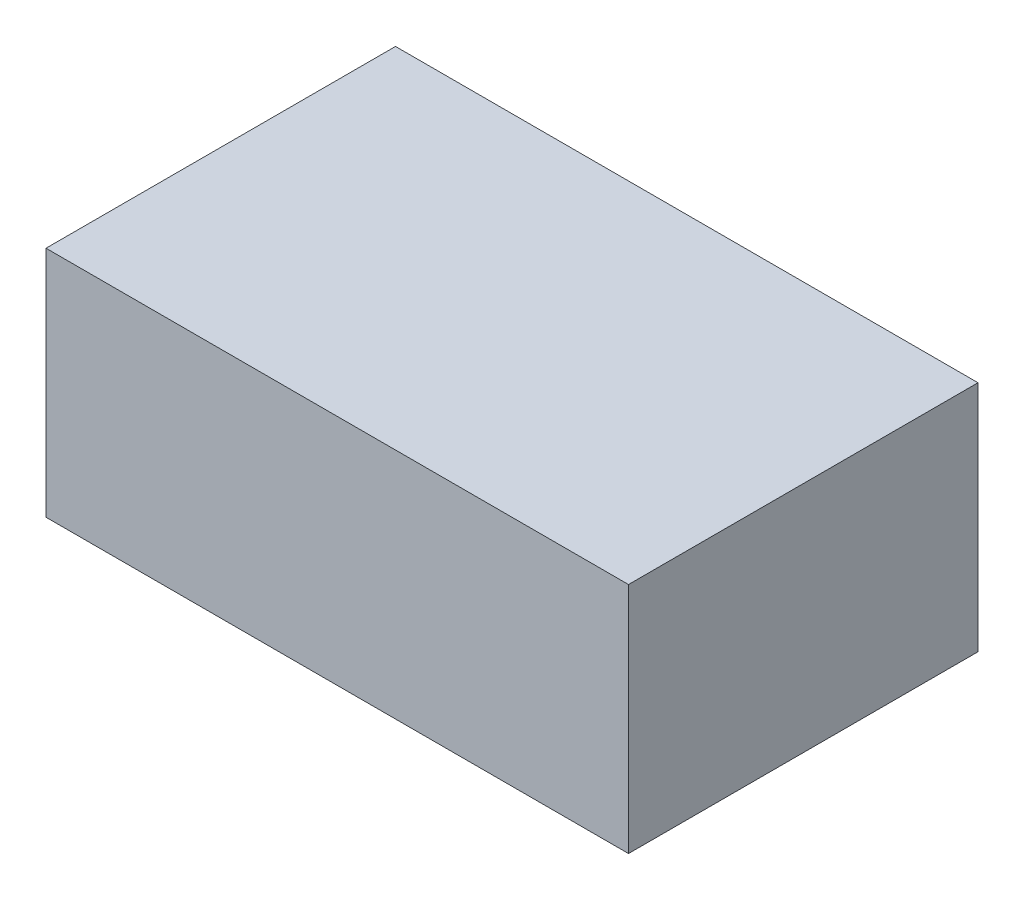
ISO-10303-21;
HEADER;
FILE_DESCRIPTION(('STEP AP214'),'2;1');
FILE_NAME('part.step','',(''),(''),'','','');
FILE_SCHEMA(('AUTOMOTIVE_DESIGN { 1 0 10303 214 1 1 1 1 }'));
ENDSEC;
DATA;
#1=APPLICATION_CONTEXT('core data for automotive mechanical design processes');
#2=APPLICATION_PROTOCOL_DEFINITION('international standard','automotive_design',2000,#1);
#3=PRODUCT_CONTEXT('',#1,'mechanical');
#4=PRODUCT('Part','Part','',(#3));
#5=PRODUCT_RELATED_PRODUCT_CATEGORY('part','',(#4));
#6=PRODUCT_DEFINITION_FORMATION('','',#4);
#7=PRODUCT_DEFINITION_CONTEXT('part definition',#1,'design');
#8=PRODUCT_DEFINITION('design','',#6,#7);
#9=PRODUCT_DEFINITION_SHAPE('','',#8);
#10=(LENGTH_UNIT() NAMED_UNIT(*) SI_UNIT(.MILLI.,.METRE.));
#11=(NAMED_UNIT(*) PLANE_ANGLE_UNIT() SI_UNIT($,.RADIAN.));
#12=(NAMED_UNIT(*) SI_UNIT($,.STERADIAN.) SOLID_ANGLE_UNIT());
#13=UNCERTAINTY_MEASURE_WITH_UNIT(LENGTH_MEASURE(1.E-05),#10,'distance_accuracy_value','');
#14=(GEOMETRIC_REPRESENTATION_CONTEXT(3) GLOBAL_UNCERTAINTY_ASSIGNED_CONTEXT((#13)) GLOBAL_UNIT_ASSIGNED_CONTEXT((#10,
#11,#12)) REPRESENTATION_CONTEXT('',''));
#15=CARTESIAN_POINT('',(0.,0.,0.));
#16=DIRECTION('',(0.,0.,1.));
#17=DIRECTION('',(1.,0.,0.));
#18=AXIS2_PLACEMENT_3D('',#15,#16,#17);
#19=CARTESIAN_POINT('',(0.,0.,0.));
#20=DIRECTION('',(0.,1.,0.));
#21=DIRECTION('',(0.,0.,1.));
#22=AXIS2_PLACEMENT_3D('',#19,#20,#21);
#23=PLANE('',#22);
#24=DIRECTION('',(0.,0.,-1.));
#25=VECTOR('',#24,1.);
#26=CARTESIAN_POINT('',(-0.45,0.,0.25));
#27=LINE('',#26,#25);
#28=CARTESIAN_POINT('',(-0.45,0.,0.25));
#29=VERTEX_POINT('',#28);
#30=CARTESIAN_POINT('',(-0.45,0.,-0.25));
#31=VERTEX_POINT('',#30);
#32=EDGE_CURVE('E143',#29,#31,#27,.T.);
#33=ORIENTED_EDGE('',*,*,#32,.F.);
#34=DIRECTION('',(-1.,0.,0.));
#35=VECTOR('',#34,1.);
#36=CARTESIAN_POINT('',(-0.45,0.,0.25));
#37=LINE('',#36,#35);
#38=CARTESIAN_POINT('',(-0.2,0.,0.25));
#39=VERTEX_POINT('',#38);
#40=EDGE_CURVE('E156',#39,#29,#37,.T.);
#41=ORIENTED_EDGE('',*,*,#40,.F.);
#42=DIRECTION('',(0.,0.,1.));
#43=VECTOR('',#42,1.);
#44=CARTESIAN_POINT('',(-0.2,0.,0.25));
#45=LINE('',#44,#43);
#46=CARTESIAN_POINT('',(-0.2,0.,-0.25));
#47=VERTEX_POINT('',#46);
#48=EDGE_CURVE('E165',#47,#39,#45,.T.);
#49=ORIENTED_EDGE('',*,*,#48,.F.);
#50=DIRECTION('',(1.,0.,0.));
#51=VECTOR('',#50,1.);
#52=CARTESIAN_POINT('',(-0.45,0.,-0.25));
#53=LINE('',#52,#51);
#54=EDGE_CURVE('E146',#31,#47,#53,.T.);
#55=ORIENTED_EDGE('',*,*,#54,.F.);
#56=EDGE_LOOP('',(#33,#41,#49,#55));
#57=FACE_BOUND('',#56,.T.);
#58=DIRECTION('',(0.,0.,-1.));
#59=VECTOR('',#58,1.);
#60=CARTESIAN_POINT('',(0.5,0.,-0.3));
#61=LINE('',#60,#59);
#62=CARTESIAN_POINT('',(0.5,0.,0.3));
#63=VERTEX_POINT('',#62);
#64=CARTESIAN_POINT('',(0.5,0.,-0.3));
#65=VERTEX_POINT('',#64);
#66=EDGE_CURVE('E181',#63,#65,#61,.T.);
#67=ORIENTED_EDGE('',*,*,#66,.F.);
#68=DIRECTION('',(1.,0.,0.));
#69=VECTOR('',#68,1.);
#70=CARTESIAN_POINT('',(-0.5,0.,0.3));
#71=LINE('',#70,#69);
#72=CARTESIAN_POINT('',(-0.5,0.,0.3));
#73=VERTEX_POINT('',#72);
#74=EDGE_CURVE('E186',#73,#63,#71,.T.);
#75=ORIENTED_EDGE('',*,*,#74,.F.);
#76=DIRECTION('',(0.,0.,1.));
#77=VECTOR('',#76,1.);
#78=CARTESIAN_POINT('',(-0.5,0.,-0.3));
#79=LINE('',#78,#77);
#80=CARTESIAN_POINT('',(-0.5,0.,-0.3));
#81=VERTEX_POINT('',#80);
#82=EDGE_CURVE('E197',#81,#73,#79,.T.);
#83=ORIENTED_EDGE('',*,*,#82,.F.);
#84=DIRECTION('',(-1.,0.,0.));
#85=VECTOR('',#84,1.);
#86=CARTESIAN_POINT('',(-0.5,0.,-0.3));
#87=LINE('',#86,#85);
#88=EDGE_CURVE('E195',#65,#81,#87,.T.);
#89=ORIENTED_EDGE('',*,*,#88,.F.);
#90=EDGE_LOOP('',(#67,#75,#83,#89));
#91=FACE_BOUND('',#90,.T.);
#92=DIRECTION('',(-1.,0.,0.));
#93=VECTOR('',#92,1.);
#94=CARTESIAN_POINT('',(0.45,0.,0.25));
#95=LINE('',#94,#93);
#96=CARTESIAN_POINT('',(0.45,0.,0.25));
#97=VERTEX_POINT('',#96);
#98=CARTESIAN_POINT('',(0.2,0.,0.25));
#99=VERTEX_POINT('',#98);
#100=EDGE_CURVE('E142',#97,#99,#95,.T.);
#101=ORIENTED_EDGE('',*,*,#100,.F.);
#102=DIRECTION('',(0.,0.,1.));
#103=VECTOR('',#102,1.);
#104=CARTESIAN_POINT('',(0.45,0.,0.25));
#105=LINE('',#104,#103);
#106=CARTESIAN_POINT('',(0.45,0.,-0.25));
#107=VERTEX_POINT('',#106);
#108=EDGE_CURVE('E139',#107,#97,#105,.T.);
#109=ORIENTED_EDGE('',*,*,#108,.F.);
#110=DIRECTION('',(1.,0.,0.));
#111=VECTOR('',#110,1.);
#112=CARTESIAN_POINT('',(0.45,0.,-0.25));
#113=LINE('',#112,#111);
#114=CARTESIAN_POINT('',(0.2,0.,-0.25));
#115=VERTEX_POINT('',#114);
#116=EDGE_CURVE('E53',#115,#107,#113,.T.);
#117=ORIENTED_EDGE('',*,*,#116,.F.);
#118=DIRECTION('',(0.,0.,-1.));
#119=VECTOR('',#118,1.);
#120=CARTESIAN_POINT('',(0.2,0.,0.25));
#121=LINE('',#120,#119);
#122=EDGE_CURVE('E48',#99,#115,#121,.T.);
#123=ORIENTED_EDGE('',*,*,#122,.F.);
#124=EDGE_LOOP('',(#101,#109,#117,#123));
#125=FACE_BOUND('',#124,.T.);
#126=ADVANCED_FACE('F33',(#57,#91,#125),#23,.F.);
#127=CARTESIAN_POINT('',(0.5,0.4,-0.3));
#128=DIRECTION('',(-1.,0.,0.));
#129=DIRECTION('',(0.,0.,1.));
#130=AXIS2_PLACEMENT_3D('',#127,#128,#129);
#131=PLANE('',#130);
#132=ORIENTED_EDGE('',*,*,#66,.T.);
#133=DIRECTION('',(0.,-1.,0.));
#134=VECTOR('',#133,1.);
#135=CARTESIAN_POINT('',(0.5,0.4,-0.3));
#136=LINE('',#135,#134);
#137=CARTESIAN_POINT('',(0.5,0.4,-0.3));
#138=VERTEX_POINT('',#137);
#139=EDGE_CURVE('E11',#138,#65,#136,.T.);
#140=ORIENTED_EDGE('',*,*,#139,.F.);
#141=DIRECTION('',(0.,0.,-1.));
#142=VECTOR('',#141,1.);
#143=CARTESIAN_POINT('',(0.5,0.4,-0.3));
#144=LINE('',#143,#142);
#145=CARTESIAN_POINT('',(0.5,0.4,0.3));
#146=VERTEX_POINT('',#145);
#147=EDGE_CURVE('E182',#146,#138,#144,.T.);
#148=ORIENTED_EDGE('',*,*,#147,.F.);
#149=DIRECTION('',(0.,-1.,0.));
#150=VECTOR('',#149,1.);
#151=CARTESIAN_POINT('',(0.5,0.4,0.3));
#152=LINE('',#151,#150);
#153=EDGE_CURVE('E192',#146,#63,#152,.T.);
#154=ORIENTED_EDGE('',*,*,#153,.T.);
#155=EDGE_LOOP('',(#132,#140,#148,#154));
#156=FACE_BOUND('',#155,.T.);
#157=ADVANCED_FACE('F35',(#156),#131,.F.);
#158=CARTESIAN_POINT('',(-0.5,0.4,-0.3));
#159=DIRECTION('',(0.,0.,1.));
#160=DIRECTION('',(1.,0.,0.));
#161=AXIS2_PLACEMENT_3D('',#158,#159,#160);
#162=PLANE('',#161);
#163=ORIENTED_EDGE('',*,*,#88,.T.);
#164=DIRECTION('',(0.,-1.,0.));
#165=VECTOR('',#164,1.);
#166=CARTESIAN_POINT('',(-0.5,0.4,-0.3));
#167=LINE('',#166,#165);
#168=CARTESIAN_POINT('',(-0.5,0.4,-0.3));
#169=VERTEX_POINT('',#168);
#170=EDGE_CURVE('E41',#169,#81,#167,.T.);
#171=ORIENTED_EDGE('',*,*,#170,.F.);
#172=DIRECTION('',(-1.,0.,0.));
#173=VECTOR('',#172,1.);
#174=CARTESIAN_POINT('',(-0.5,0.4,-0.3));
#175=LINE('',#174,#173);
#176=EDGE_CURVE('E185',#138,#169,#175,.T.);
#177=ORIENTED_EDGE('',*,*,#176,.F.);
#178=ORIENTED_EDGE('',*,*,#139,.T.);
#179=EDGE_LOOP('',(#163,#171,#177,#178));
#180=FACE_BOUND('',#179,.T.);
#181=ADVANCED_FACE('F224',(#180),#162,.F.);
#182=CARTESIAN_POINT('',(-0.5,0.4,-0.3));
#183=DIRECTION('',(1.,0.,0.));
#184=DIRECTION('',(0.,0.,-1.));
#185=AXIS2_PLACEMENT_3D('',#182,#183,#184);
#186=PLANE('',#185);
#187=ORIENTED_EDGE('',*,*,#82,.T.);
#188=DIRECTION('',(0.,-1.,0.));
#189=VECTOR('',#188,1.);
#190=CARTESIAN_POINT('',(-0.5,0.4,0.3));
#191=LINE('',#190,#189);
#192=CARTESIAN_POINT('',(-0.5,0.4,0.3));
#193=VERTEX_POINT('',#192);
#194=EDGE_CURVE('E202',#193,#73,#191,.T.);
#195=ORIENTED_EDGE('',*,*,#194,.F.);
#196=DIRECTION('',(0.,0.,1.));
#197=VECTOR('',#196,1.);
#198=CARTESIAN_POINT('',(-0.5,0.4,-0.3));
#199=LINE('',#198,#197);
#200=EDGE_CURVE('E188',#169,#193,#199,.T.);
#201=ORIENTED_EDGE('',*,*,#200,.F.);
#202=ORIENTED_EDGE('',*,*,#170,.T.);
#203=EDGE_LOOP('',(#187,#195,#201,#202));
#204=FACE_BOUND('',#203,.T.);
#205=ADVANCED_FACE('F209',(#204),#186,.F.);
#206=CARTESIAN_POINT('',(-0.5,0.4,0.3));
#207=DIRECTION('',(0.,0.,-1.));
#208=DIRECTION('',(-1.,0.,0.));
#209=AXIS2_PLACEMENT_3D('',#206,#207,#208);
#210=PLANE('',#209);
#211=ORIENTED_EDGE('',*,*,#74,.T.);
#212=ORIENTED_EDGE('',*,*,#153,.F.);
#213=DIRECTION('',(1.,0.,0.));
#214=VECTOR('',#213,1.);
#215=CARTESIAN_POINT('',(-0.5,0.4,0.3));
#216=LINE('',#215,#214);
#217=EDGE_CURVE('E190',#193,#146,#216,.T.);
#218=ORIENTED_EDGE('',*,*,#217,.F.);
#219=ORIENTED_EDGE('',*,*,#194,.T.);
#220=EDGE_LOOP('',(#211,#212,#218,#219));
#221=FACE_BOUND('',#220,.T.);
#222=ADVANCED_FACE('F217',(#221),#210,.F.);
#223=CARTESIAN_POINT('',(0.,0.4,0.));
#224=DIRECTION('',(0.,1.,0.));
#225=DIRECTION('',(0.,0.,1.));
#226=AXIS2_PLACEMENT_3D('',#223,#224,#225);
#227=PLANE('',#226);
#228=ORIENTED_EDGE('',*,*,#147,.T.);
#229=ORIENTED_EDGE('',*,*,#176,.T.);
#230=ORIENTED_EDGE('',*,*,#200,.T.);
#231=ORIENTED_EDGE('',*,*,#217,.T.);
#232=EDGE_LOOP('',(#228,#229,#230,#231));
#233=FACE_BOUND('',#232,.T.);
#234=ADVANCED_FACE('F223',(#233),#227,.T.);
#235=CARTESIAN_POINT('',(-0.45,-0.05,0.25));
#236=DIRECTION('',(1.,0.,0.));
#237=DIRECTION('',(0.,0.,-1.));
#238=AXIS2_PLACEMENT_3D('',#235,#236,#237);
#239=PLANE('',#238);
#240=ORIENTED_EDGE('',*,*,#32,.T.);
#241=DIRECTION('',(0.,1.,0.));
#242=VECTOR('',#241,1.);
#243=CARTESIAN_POINT('',(-0.45,-0.05,-0.25));
#244=LINE('',#243,#242);
#245=CARTESIAN_POINT('',(-0.45,-0.05,-0.25));
#246=VERTEX_POINT('',#245);
#247=EDGE_CURVE('E178',#246,#31,#244,.T.);
#248=ORIENTED_EDGE('',*,*,#247,.F.);
#249=DIRECTION('',(0.,0.,-1.));
#250=VECTOR('',#249,1.);
#251=CARTESIAN_POINT('',(-0.45,-0.05,0.25));
#252=LINE('',#251,#250);
#253=CARTESIAN_POINT('',(-0.45,-0.05,0.25));
#254=VERTEX_POINT('',#253);
#255=EDGE_CURVE('E152',#254,#246,#252,.T.);
#256=ORIENTED_EDGE('',*,*,#255,.F.);
#257=DIRECTION('',(0.,1.,0.));
#258=VECTOR('',#257,1.);
#259=CARTESIAN_POINT('',(-0.45,-0.05,0.25));
#260=LINE('',#259,#258);
#261=EDGE_CURVE('E161',#254,#29,#260,.T.);
#262=ORIENTED_EDGE('',*,*,#261,.T.);
#263=EDGE_LOOP('',(#240,#248,#256,#262));
#264=FACE_BOUND('',#263,.T.);
#265=ADVANCED_FACE('F243',(#264),#239,.F.);
#266=CARTESIAN_POINT('',(-0.45,-0.05,-0.25));
#267=DIRECTION('',(0.,0.,1.));
#268=DIRECTION('',(1.,0.,0.));
#269=AXIS2_PLACEMENT_3D('',#266,#267,#268);
#270=PLANE('',#269);
#271=ORIENTED_EDGE('',*,*,#54,.T.);
#272=DIRECTION('',(0.,1.,0.));
#273=VECTOR('',#272,1.);
#274=CARTESIAN_POINT('',(-0.2,-0.05,-0.25));
#275=LINE('',#274,#273);
#276=CARTESIAN_POINT('',(-0.2,-0.05,-0.25));
#277=VERTEX_POINT('',#276);
#278=EDGE_CURVE('E175',#277,#47,#275,.T.);
#279=ORIENTED_EDGE('',*,*,#278,.F.);
#280=DIRECTION('',(1.,0.,0.));
#281=VECTOR('',#280,1.);
#282=CARTESIAN_POINT('',(-0.45,-0.05,-0.25));
#283=LINE('',#282,#281);
#284=EDGE_CURVE('E155',#246,#277,#283,.T.);
#285=ORIENTED_EDGE('',*,*,#284,.F.);
#286=ORIENTED_EDGE('',*,*,#247,.T.);
#287=EDGE_LOOP('',(#271,#279,#285,#286));
#288=FACE_BOUND('',#287,.T.);
#289=ADVANCED_FACE('F247',(#288),#270,.F.);
#290=CARTESIAN_POINT('',(-0.2,-0.05,0.25));
#291=DIRECTION('',(-1.,0.,0.));
#292=DIRECTION('',(0.,0.,1.));
#293=AXIS2_PLACEMENT_3D('',#290,#291,#292);
#294=PLANE('',#293);
#295=ORIENTED_EDGE('',*,*,#48,.T.);
#296=DIRECTION('',(0.,1.,0.));
#297=VECTOR('',#296,1.);
#298=CARTESIAN_POINT('',(-0.2,-0.05,0.25));
#299=LINE('',#298,#297);
#300=CARTESIAN_POINT('',(-0.2,-0.05,0.25));
#301=VERTEX_POINT('',#300);
#302=EDGE_CURVE('E172',#301,#39,#299,.T.);
#303=ORIENTED_EDGE('',*,*,#302,.F.);
#304=DIRECTION('',(0.,0.,1.));
#305=VECTOR('',#304,1.);
#306=CARTESIAN_POINT('',(-0.2,-0.05,0.25));
#307=LINE('',#306,#305);
#308=EDGE_CURVE('E158',#277,#301,#307,.T.);
#309=ORIENTED_EDGE('',*,*,#308,.F.);
#310=ORIENTED_EDGE('',*,*,#278,.T.);
#311=EDGE_LOOP('',(#295,#303,#309,#310));
#312=FACE_BOUND('',#311,.T.);
#313=ADVANCED_FACE('F252',(#312),#294,.F.);
#314=CARTESIAN_POINT('',(-0.45,-0.05,0.25));
#315=DIRECTION('',(0.,0.,-1.));
#316=DIRECTION('',(-1.,0.,0.));
#317=AXIS2_PLACEMENT_3D('',#314,#315,#316);
#318=PLANE('',#317);
#319=ORIENTED_EDGE('',*,*,#40,.T.);
#320=ORIENTED_EDGE('',*,*,#261,.F.);
#321=DIRECTION('',(-1.,0.,0.));
#322=VECTOR('',#321,1.);
#323=CARTESIAN_POINT('',(-0.45,-0.05,0.25));
#324=LINE('',#323,#322);
#325=EDGE_CURVE('E160',#301,#254,#324,.T.);
#326=ORIENTED_EDGE('',*,*,#325,.F.);
#327=ORIENTED_EDGE('',*,*,#302,.T.);
#328=EDGE_LOOP('',(#319,#320,#326,#327));
#329=FACE_BOUND('',#328,.T.);
#330=ADVANCED_FACE('F258',(#329),#318,.F.);
#331=CARTESIAN_POINT('',(0.,-0.05,0.));
#332=DIRECTION('',(0.,-1.,0.));
#333=DIRECTION('',(0.,0.,-1.));
#334=AXIS2_PLACEMENT_3D('',#331,#332,#333);
#335=PLANE('',#334);
#336=ORIENTED_EDGE('',*,*,#255,.T.);
#337=ORIENTED_EDGE('',*,*,#284,.T.);
#338=ORIENTED_EDGE('',*,*,#308,.T.);
#339=ORIENTED_EDGE('',*,*,#325,.T.);
#340=EDGE_LOOP('',(#336,#337,#338,#339));
#341=FACE_BOUND('',#340,.T.);
#342=ADVANCED_FACE('F262',(#341),#335,.T.);
#343=CARTESIAN_POINT('',(0.45,-0.05,0.25));
#344=DIRECTION('',(0.,0.,-1.));
#345=DIRECTION('',(-1.,0.,0.));
#346=AXIS2_PLACEMENT_3D('',#343,#344,#345);
#347=PLANE('',#346);
#348=ORIENTED_EDGE('',*,*,#100,.T.);
#349=DIRECTION('',(0.,1.,0.));
#350=VECTOR('',#349,1.);
#351=CARTESIAN_POINT('',(0.2,-0.05,0.25));
#352=LINE('',#351,#350);
#353=CARTESIAN_POINT('',(0.2,-0.05,0.25));
#354=VERTEX_POINT('',#353);
#355=EDGE_CURVE('E123',#354,#99,#352,.T.);
#356=ORIENTED_EDGE('',*,*,#355,.F.);
#357=DIRECTION('',(-1.,0.,0.));
#358=VECTOR('',#357,1.);
#359=CARTESIAN_POINT('',(0.45,-0.05,0.25));
#360=LINE('',#359,#358);
#361=CARTESIAN_POINT('',(0.45,-0.05,0.25));
#362=VERTEX_POINT('',#361);
#363=EDGE_CURVE('E130',#362,#354,#360,.T.);
#364=ORIENTED_EDGE('',*,*,#363,.F.);
#365=DIRECTION('',(0.,1.,0.));
#366=VECTOR('',#365,1.);
#367=CARTESIAN_POINT('',(0.45,-0.05,0.25));
#368=LINE('',#367,#366);
#369=EDGE_CURVE('E368',#362,#97,#368,.T.);
#370=ORIENTED_EDGE('',*,*,#369,.T.);
#371=EDGE_LOOP('',(#348,#356,#364,#370));
#372=FACE_BOUND('',#371,.T.);
#373=ADVANCED_FACE('F141',(#372),#347,.F.);
#374=CARTESIAN_POINT('',(0.2,-0.05,0.25));
#375=DIRECTION('',(1.,0.,0.));
#376=DIRECTION('',(0.,0.,-1.));
#377=AXIS2_PLACEMENT_3D('',#374,#375,#376);
#378=PLANE('',#377);
#379=ORIENTED_EDGE('',*,*,#122,.T.);
#380=DIRECTION('',(0.,1.,0.));
#381=VECTOR('',#380,1.);
#382=CARTESIAN_POINT('',(0.2,-0.05,-0.25));
#383=LINE('',#382,#381);
#384=CARTESIAN_POINT('',(0.2,-0.05,-0.25));
#385=VERTEX_POINT('',#384);
#386=EDGE_CURVE('E126',#385,#115,#383,.T.);
#387=ORIENTED_EDGE('',*,*,#386,.F.);
#388=DIRECTION('',(0.,0.,-1.));
#389=VECTOR('',#388,1.);
#390=CARTESIAN_POINT('',(0.2,-0.05,0.25));
#391=LINE('',#390,#389);
#392=EDGE_CURVE('E119',#354,#385,#391,.T.);
#393=ORIENTED_EDGE('',*,*,#392,.F.);
#394=ORIENTED_EDGE('',*,*,#355,.T.);
#395=EDGE_LOOP('',(#379,#387,#393,#394));
#396=FACE_BOUND('',#395,.T.);
#397=ADVANCED_FACE('F121',(#396),#378,.F.);
#398=CARTESIAN_POINT('',(0.45,-0.05,-0.25));
#399=DIRECTION('',(0.,0.,1.));
#400=DIRECTION('',(1.,0.,0.));
#401=AXIS2_PLACEMENT_3D('',#398,#399,#400);
#402=PLANE('',#401);
#403=ORIENTED_EDGE('',*,*,#116,.T.);
#404=DIRECTION('',(0.,1.,0.));
#405=VECTOR('',#404,1.);
#406=CARTESIAN_POINT('',(0.45,-0.05,-0.25));
#407=LINE('',#406,#405);
#408=CARTESIAN_POINT('',(0.45,-0.05,-0.25));
#409=VERTEX_POINT('',#408);
#410=EDGE_CURVE('E148',#409,#107,#407,.T.);
#411=ORIENTED_EDGE('',*,*,#410,.F.);
#412=DIRECTION('',(1.,0.,0.));
#413=VECTOR('',#412,1.);
#414=CARTESIAN_POINT('',(0.45,-0.05,-0.25));
#415=LINE('',#414,#413);
#416=EDGE_CURVE('E129',#385,#409,#415,.T.);
#417=ORIENTED_EDGE('',*,*,#416,.F.);
#418=ORIENTED_EDGE('',*,*,#386,.T.);
#419=EDGE_LOOP('',(#403,#411,#417,#418));
#420=FACE_BOUND('',#419,.T.);
#421=ADVANCED_FACE('F271',(#420),#402,.F.);
#422=CARTESIAN_POINT('',(0.45,-0.05,0.25));
#423=DIRECTION('',(-1.,0.,0.));
#424=DIRECTION('',(0.,0.,1.));
#425=AXIS2_PLACEMENT_3D('',#422,#423,#424);
#426=PLANE('',#425);
#427=ORIENTED_EDGE('',*,*,#108,.T.);
#428=ORIENTED_EDGE('',*,*,#369,.F.);
#429=DIRECTION('',(0.,0.,1.));
#430=VECTOR('',#429,1.);
#431=CARTESIAN_POINT('',(0.45,-0.05,0.25));
#432=LINE('',#431,#430);
#433=EDGE_CURVE('E135',#409,#362,#432,.T.);
#434=ORIENTED_EDGE('',*,*,#433,.F.);
#435=ORIENTED_EDGE('',*,*,#410,.T.);
#436=EDGE_LOOP('',(#427,#428,#434,#435));
#437=FACE_BOUND('',#436,.T.);
#438=ADVANCED_FACE('F274',(#437),#426,.F.);
#439=CARTESIAN_POINT('',(0.,-0.05,0.));
#440=DIRECTION('',(0.,-1.,0.));
#441=DIRECTION('',(0.,0.,-1.));
#442=AXIS2_PLACEMENT_3D('',#439,#440,#441);
#443=PLANE('',#442);
#444=ORIENTED_EDGE('',*,*,#363,.T.);
#445=ORIENTED_EDGE('',*,*,#392,.T.);
#446=ORIENTED_EDGE('',*,*,#416,.T.);
#447=ORIENTED_EDGE('',*,*,#433,.T.);
#448=EDGE_LOOP('',(#444,#445,#446,#447));
#449=FACE_BOUND('',#448,.T.);
#450=ADVANCED_FACE('F133',(#449),#443,.T.);
#451=CLOSED_SHELL('',(#126,#157,#181,#205,#222,#234,#265,#289,#313,#330,#342,#373,#397,#421,
#438,#450));
#452=MANIFOLD_SOLID_BREP('B2',#451);
#453=ADVANCED_BREP_SHAPE_REPRESENTATION('',(#18,#452),#14);
#454=SHAPE_DEFINITION_REPRESENTATION(#9,#453);
ENDSEC;
END-ISO-10303-21;
